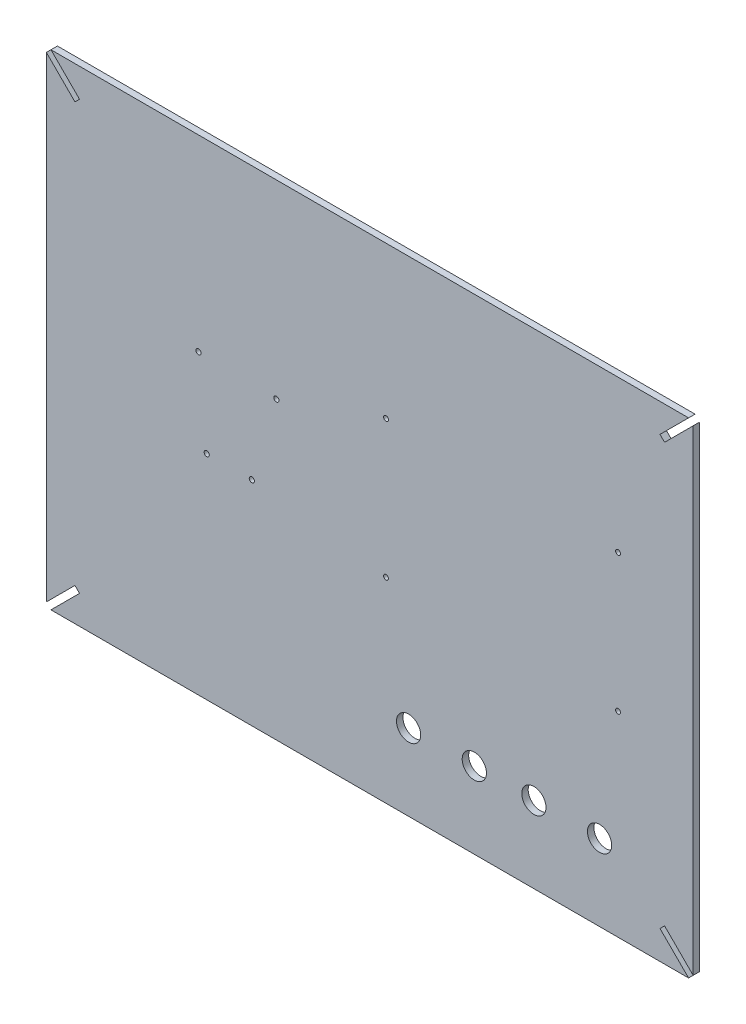
ISO-10303-21;
HEADER;
FILE_DESCRIPTION(('STEP AP214'),'2;1');
FILE_NAME('part.step','',(''),(''),'','','');
FILE_SCHEMA(('AUTOMOTIVE_DESIGN { 1 0 10303 214 1 1 1 1 }'));
ENDSEC;
DATA;
#1=APPLICATION_CONTEXT('core data for automotive mechanical design processes');
#2=APPLICATION_PROTOCOL_DEFINITION('international standard','automotive_design',2000,#1);
#3=PRODUCT_CONTEXT('',#1,'mechanical');
#4=PRODUCT('Part','Part','',(#3));
#5=PRODUCT_RELATED_PRODUCT_CATEGORY('part','',(#4));
#6=PRODUCT_DEFINITION_FORMATION('','',#4);
#7=PRODUCT_DEFINITION_CONTEXT('part definition',#1,'design');
#8=PRODUCT_DEFINITION('design','',#6,#7);
#9=PRODUCT_DEFINITION_SHAPE('','',#8);
#10=(LENGTH_UNIT() NAMED_UNIT(*) SI_UNIT(.MILLI.,.METRE.));
#11=(NAMED_UNIT(*) PLANE_ANGLE_UNIT() SI_UNIT($,.RADIAN.));
#12=(NAMED_UNIT(*) SI_UNIT($,.STERADIAN.) SOLID_ANGLE_UNIT());
#13=UNCERTAINTY_MEASURE_WITH_UNIT(LENGTH_MEASURE(1.E-05),#10,'distance_accuracy_value','');
#14=(GEOMETRIC_REPRESENTATION_CONTEXT(3) GLOBAL_UNCERTAINTY_ASSIGNED_CONTEXT((#13)) GLOBAL_UNIT_ASSIGNED_CONTEXT((#10,
#11,#12)) REPRESENTATION_CONTEXT('',''));
#15=CARTESIAN_POINT('',(0.,0.,0.));
#16=DIRECTION('',(0.,0.,1.));
#17=DIRECTION('',(1.,0.,0.));
#18=AXIS2_PLACEMENT_3D('',#15,#16,#17);
#19=CARTESIAN_POINT('',(-426.178692145528,101.472557330727,4.));
#20=DIRECTION('',(0.,0.,-1.));
#21=DIRECTION('',(-1.,0.,0.));
#22=AXIS2_PLACEMENT_3D('',#19,#20,#21);
#23=PLANE('',#22);
#24=CARTESIAN_POINT('',(-182.029788799938,-133.60477313961,4.));
#25=DIRECTION('',(0.,0.,1.));
#26=DIRECTION('',(1.,0.,0.));
#27=AXIS2_PLACEMENT_3D('',#24,#25,#26);
#28=CIRCLE('',#27,7.50000000000001);
#29=CARTESIAN_POINT('',(-174.529788799938,-133.60477313961,4.));
#30=VERTEX_POINT('',#29);
#31=EDGE_CURVE('E374',#30,#30,#28,.T.);
#32=ORIENTED_EDGE('',*,*,#31,.F.);
#33=EDGE_LOOP('',(#32));
#34=FACE_BOUND('',#33,.T.);
#35=CARTESIAN_POINT('',(-104.559788799938,-133.60477313961,4.));
#36=DIRECTION('',(0.,0.,1.));
#37=DIRECTION('',(1.,0.,0.));
#38=AXIS2_PLACEMENT_3D('',#35,#36,#37);
#39=CIRCLE('',#38,7.50000000000001);
#40=CARTESIAN_POINT('',(-97.0597887999377,-133.60477313961,4.));
#41=VERTEX_POINT('',#40);
#42=EDGE_CURVE('E386',#41,#41,#39,.T.);
#43=ORIENTED_EDGE('',*,*,#42,.F.);
#44=EDGE_LOOP('',(#43));
#45=FACE_BOUND('',#44,.T.);
#46=CARTESIAN_POINT('',(-352.634788799938,3.05022686039043,4.));
#47=DIRECTION('',(0.,0.,1.));
#48=DIRECTION('',(1.,0.,0.));
#49=AXIS2_PLACEMENT_3D('',#46,#47,#48);
#50=CIRCLE('',#49,1.59999999999996);
#51=CARTESIAN_POINT('',(-351.034788799938,3.05022686039043,4.));
#52=VERTEX_POINT('',#51);
#53=EDGE_CURVE('E398',#52,#52,#50,.T.);
#54=ORIENTED_EDGE('',*,*,#53,.F.);
#55=EDGE_LOOP('',(#54));
#56=FACE_BOUND('',#55,.T.);
#57=CARTESIAN_POINT('',(-347.534788799938,-49.0497731396096,4.));
#58=DIRECTION('',(0.,0.,1.));
#59=DIRECTION('',(1.,0.,0.));
#60=AXIS2_PLACEMENT_3D('',#57,#58,#59);
#61=CIRCLE('',#60,1.59999999999996);
#62=CARTESIAN_POINT('',(-345.934788799938,-49.0497731396096,4.));
#63=VERTEX_POINT('',#62);
#64=EDGE_CURVE('E410',#63,#63,#61,.T.);
#65=ORIENTED_EDGE('',*,*,#64,.F.);
#66=EDGE_LOOP('',(#65));
#67=FACE_BOUND('',#66,.T.);
#68=CARTESIAN_POINT('',(-236.639788799938,-59.7947731396096,4.));
#69=DIRECTION('',(0.,0.,1.));
#70=DIRECTION('',(-1.,0.,0.));
#71=AXIS2_PLACEMENT_3D('',#68,#69,#70);
#72=CIRCLE('',#71,1.5);
#73=CARTESIAN_POINT('',(-238.139788799938,-59.7947731396096,4.));
#74=VERTEX_POINT('',#73);
#75=EDGE_CURVE('E422',#74,#74,#72,.T.);
#76=ORIENTED_EDGE('',*,*,#75,.F.);
#77=EDGE_LOOP('',(#76));
#78=FACE_BOUND('',#77,.T.);
#79=CARTESIAN_POINT('',(-236.639788799938,25.2952268603904,4.));
#80=DIRECTION('',(0.,0.,1.));
#81=DIRECTION('',(1.,0.,0.));
#82=AXIS2_PLACEMENT_3D('',#79,#80,#81);
#83=CIRCLE('',#82,1.5);
#84=CARTESIAN_POINT('',(-235.139788799938,25.2952268603904,4.));
#85=VERTEX_POINT('',#84);
#86=EDGE_CURVE('E180',#85,#85,#83,.T.);
#87=ORIENTED_EDGE('',*,*,#86,.F.);
#88=EDGE_LOOP('',(#87));
#89=FACE_BOUND('',#88,.T.);
#90=DIRECTION('',(0.707106781186548,-0.707106781186547,0.));
#91=VECTOR('',#90,1.);
#92=CARTESIAN_POINT('',(-443.856361675192,119.15022686039,4.));
#93=LINE('',#92,#91);
#94=CARTESIAN_POINT('',(-443.856361675192,119.15022686039,4.));
#95=VERTEX_POINT('',#94);
#96=CARTESIAN_POINT('',(-426.178692145528,101.472557330727,4.));
#97=VERTEX_POINT('',#96);
#98=EDGE_CURVE('E207',#95,#97,#93,.T.);
#99=ORIENTED_EDGE('',*,*,#98,.T.);
#100=DIRECTION('',(-0.707106781186547,-0.707106781186547,0.));
#101=VECTOR('',#100,1.);
#102=CARTESIAN_POINT('',(-426.178692145528,101.472557330727,4.));
#103=LINE('',#102,#101);
#104=CARTESIAN_POINT('',(-429.007119270274,98.6441302059806,4.));
#105=VERTEX_POINT('',#104);
#106=EDGE_CURVE('E115',#97,#105,#103,.T.);
#107=ORIENTED_EDGE('',*,*,#106,.T.);
#108=DIRECTION('',(-0.707106781186546,0.707106781186549,0.));
#109=VECTOR('',#108,1.);
#110=CARTESIAN_POINT('',(-429.007119270274,98.6441302059806,4.));
#111=LINE('',#110,#109);
#112=CARTESIAN_POINT('',(-446.684788799938,116.321799735644,4.));
#113=VERTEX_POINT('',#112);
#114=EDGE_CURVE('E246',#105,#113,#111,.T.);
#115=ORIENTED_EDGE('',*,*,#114,.T.);
#116=DIRECTION('',(0.,-1.,0.));
#117=VECTOR('',#116,1.);
#118=CARTESIAN_POINT('',(-446.684788799938,116.321799735644,4.));
#119=LINE('',#118,#117);
#120=CARTESIAN_POINT('',(-446.684788799937,-178.021346014864,4.));
#121=VERTEX_POINT('',#120);
#122=EDGE_CURVE('E265',#113,#121,#119,.T.);
#123=ORIENTED_EDGE('',*,*,#122,.T.);
#124=DIRECTION('',(0.707106781186544,0.707106781186551,0.));
#125=VECTOR('',#124,1.);
#126=CARTESIAN_POINT('',(-429.007119270274,-160.3436764852,4.));
#127=LINE('',#126,#125);
#128=CARTESIAN_POINT('',(-429.007119270274,-160.3436764852,4.));
#129=VERTEX_POINT('',#128);
#130=EDGE_CURVE('E262',#121,#129,#127,.T.);
#131=ORIENTED_EDGE('',*,*,#130,.T.);
#132=DIRECTION('',(0.707106781186554,-0.707106781186541,0.));
#133=VECTOR('',#132,1.);
#134=CARTESIAN_POINT('',(-426.178692145527,-163.172103609946,4.));
#135=LINE('',#134,#133);
#136=CARTESIAN_POINT('',(-426.178692145527,-163.172103609946,4.));
#137=VERTEX_POINT('',#136);
#138=EDGE_CURVE('E264',#129,#137,#135,.T.);
#139=ORIENTED_EDGE('',*,*,#138,.T.);
#140=DIRECTION('',(-0.707106781186548,-0.707106781186547,0.));
#141=VECTOR('',#140,1.);
#142=CARTESIAN_POINT('',(-443.856361675191,-180.84977313961,4.));
#143=LINE('',#142,#141);
#144=CARTESIAN_POINT('',(-443.856361675191,-180.84977313961,4.));
#145=VERTEX_POINT('',#144);
#146=EDGE_CURVE('E267',#137,#145,#143,.T.);
#147=ORIENTED_EDGE('',*,*,#146,.T.);
#148=DIRECTION('',(1.,0.,0.));
#149=VECTOR('',#148,1.);
#150=CARTESIAN_POINT('',(-443.856361675191,-180.84977313961,4.));
#151=LINE('',#150,#149);
#152=CARTESIAN_POINT('',(-49.5132159246837,-180.84977313961,4.));
#153=VERTEX_POINT('',#152);
#154=EDGE_CURVE('E273',#145,#153,#151,.T.);
#155=ORIENTED_EDGE('',*,*,#154,.T.);
#156=DIRECTION('',(-0.70710678118655,0.707106781186546,0.));
#157=VECTOR('',#156,1.);
#158=CARTESIAN_POINT('',(-67.1908854543475,-163.172103609946,4.));
#159=LINE('',#158,#157);
#160=CARTESIAN_POINT('',(-67.1908854543475,-163.172103609946,4.));
#161=VERTEX_POINT('',#160);
#162=EDGE_CURVE('E275',#153,#161,#159,.T.);
#163=ORIENTED_EDGE('',*,*,#162,.T.);
#164=DIRECTION('',(0.707106781186539,0.707106781186556,0.));
#165=VECTOR('',#164,1.);
#166=CARTESIAN_POINT('',(-64.3624583296013,-160.3436764852,4.));
#167=LINE('',#166,#165);
#168=CARTESIAN_POINT('',(-64.3624583296013,-160.3436764852,4.));
#169=VERTEX_POINT('',#168);
#170=EDGE_CURVE('E277',#161,#169,#167,.T.);
#171=ORIENTED_EDGE('',*,*,#170,.T.);
#172=DIRECTION('',(0.707106781186549,-0.707106781186547,0.));
#173=VECTOR('',#172,1.);
#174=CARTESIAN_POINT('',(-46.6847887999376,-178.021346014864,4.));
#175=LINE('',#174,#173);
#176=CARTESIAN_POINT('',(-46.6847887999376,-178.021346014864,4.));
#177=VERTEX_POINT('',#176);
#178=EDGE_CURVE('E279',#169,#177,#175,.T.);
#179=ORIENTED_EDGE('',*,*,#178,.T.);
#180=DIRECTION('',(0.,1.,0.));
#181=VECTOR('',#180,1.);
#182=CARTESIAN_POINT('',(-46.6847887999376,-178.021346014864,4.));
#183=LINE('',#182,#181);
#184=CARTESIAN_POINT('',(-46.6847887999377,116.321799735644,4.));
#185=VERTEX_POINT('',#184);
#186=EDGE_CURVE('E281',#177,#185,#183,.T.);
#187=ORIENTED_EDGE('',*,*,#186,.T.);
#188=DIRECTION('',(-0.707106781186546,-0.707106781186549,0.));
#189=VECTOR('',#188,1.);
#190=CARTESIAN_POINT('',(-46.6847887999377,116.321799735644,4.));
#191=LINE('',#190,#189);
#192=CARTESIAN_POINT('',(-64.3624583296014,98.6441302059805,4.));
#193=VERTEX_POINT('',#192);
#194=EDGE_CURVE('E158',#185,#193,#191,.T.);
#195=ORIENTED_EDGE('',*,*,#194,.T.);
#196=DIRECTION('',(-0.707106781186553,0.707106781186542,0.));
#197=VECTOR('',#196,1.);
#198=CARTESIAN_POINT('',(-64.3624583296014,98.6441302059805,4.));
#199=LINE('',#198,#197);
#200=CARTESIAN_POINT('',(-67.1908854543476,101.472557330727,4.));
#201=VERTEX_POINT('',#200);
#202=EDGE_CURVE('E152',#193,#201,#199,.T.);
#203=ORIENTED_EDGE('',*,*,#202,.T.);
#204=DIRECTION('',(0.707106781186546,0.707106781186549,0.));
#205=VECTOR('',#204,1.);
#206=CARTESIAN_POINT('',(-67.1908854543476,101.472557330727,4.));
#207=LINE('',#206,#205);
#208=CARTESIAN_POINT('',(-49.5132159246839,119.15022686039,4.));
#209=VERTEX_POINT('',#208);
#210=EDGE_CURVE('E156',#201,#209,#207,.T.);
#211=ORIENTED_EDGE('',*,*,#210,.T.);
#212=DIRECTION('',(-1.,0.,0.));
#213=VECTOR('',#212,1.);
#214=CARTESIAN_POINT('',(-443.856361675192,119.15022686039,4.));
#215=LINE('',#214,#213);
#216=EDGE_CURVE('E48',#209,#95,#215,.T.);
#217=ORIENTED_EDGE('',*,*,#216,.T.);
#218=EDGE_LOOP('',(#99,#107,#115,#123,#131,#139,#147,#155,#163,#171,#179,#187,#195,#203,#211,#217));
#219=FACE_BOUND('',#218,.T.);
#220=CARTESIAN_POINT('',(-93.1297887999377,25.2952268603905,4.));
#221=DIRECTION('',(0.,0.,1.));
#222=DIRECTION('',(-1.,0.,0.));
#223=AXIS2_PLACEMENT_3D('',#220,#221,#222);
#224=CIRCLE('',#223,1.5);
#225=CARTESIAN_POINT('',(-94.6297887999377,25.2952268603905,4.));
#226=VERTEX_POINT('',#225);
#227=EDGE_CURVE('E428',#226,#226,#224,.T.);
#228=ORIENTED_EDGE('',*,*,#227,.F.);
#229=EDGE_LOOP('',(#228));
#230=FACE_BOUND('',#229,.T.);
#231=CARTESIAN_POINT('',(-93.1297887999377,-59.7947731396095,4.));
#232=DIRECTION('',(0.,0.,1.));
#233=DIRECTION('',(1.,0.,0.));
#234=AXIS2_PLACEMENT_3D('',#231,#232,#233);
#235=CIRCLE('',#234,1.5);
#236=CARTESIAN_POINT('',(-91.6297887999377,-59.7947731396095,4.));
#237=VERTEX_POINT('',#236);
#238=EDGE_CURVE('E416',#237,#237,#235,.T.);
#239=ORIENTED_EDGE('',*,*,#238,.F.);
#240=EDGE_LOOP('',(#239));
#241=FACE_BOUND('',#240,.T.);
#242=CARTESIAN_POINT('',(-319.634788799938,-49.0497731396096,4.));
#243=DIRECTION('',(0.,0.,1.));
#244=DIRECTION('',(1.,0.,0.));
#245=AXIS2_PLACEMENT_3D('',#242,#243,#244);
#246=CIRCLE('',#245,1.59999999999996);
#247=CARTESIAN_POINT('',(-318.034788799938,-49.0497731396096,4.));
#248=VERTEX_POINT('',#247);
#249=EDGE_CURVE('E404',#248,#248,#246,.T.);
#250=ORIENTED_EDGE('',*,*,#249,.F.);
#251=EDGE_LOOP('',(#250));
#252=FACE_BOUND('',#251,.T.);
#253=CARTESIAN_POINT('',(-304.434788799938,1.75022686039043,4.));
#254=DIRECTION('',(0.,0.,1.));
#255=DIRECTION('',(1.,0.,0.));
#256=AXIS2_PLACEMENT_3D('',#253,#254,#255);
#257=CIRCLE('',#256,1.59999999999996);
#258=CARTESIAN_POINT('',(-302.834788799938,1.75022686039043,4.));
#259=VERTEX_POINT('',#258);
#260=EDGE_CURVE('E392',#259,#259,#257,.T.);
#261=ORIENTED_EDGE('',*,*,#260,.F.);
#262=EDGE_LOOP('',(#261));
#263=FACE_BOUND('',#262,.T.);
#264=CARTESIAN_POINT('',(-145.199788799938,-133.60477313961,4.));
#265=DIRECTION('',(0.,0.,1.));
#266=DIRECTION('',(1.,0.,0.));
#267=AXIS2_PLACEMENT_3D('',#264,#265,#266);
#268=CIRCLE('',#267,7.50000000000001);
#269=CARTESIAN_POINT('',(-137.699788799938,-133.60477313961,4.));
#270=VERTEX_POINT('',#269);
#271=EDGE_CURVE('E380',#270,#270,#268,.T.);
#272=ORIENTED_EDGE('',*,*,#271,.F.);
#273=EDGE_LOOP('',(#272));
#274=FACE_BOUND('',#273,.T.);
#275=CARTESIAN_POINT('',(-222.669788799938,-133.60477313961,4.));
#276=DIRECTION('',(0.,0.,1.));
#277=DIRECTION('',(1.,0.,0.));
#278=AXIS2_PLACEMENT_3D('',#275,#276,#277);
#279=CIRCLE('',#278,7.50000000000001);
#280=CARTESIAN_POINT('',(-215.169788799938,-133.60477313961,4.));
#281=VERTEX_POINT('',#280);
#282=EDGE_CURVE('E365',#281,#281,#279,.T.);
#283=ORIENTED_EDGE('',*,*,#282,.F.);
#284=EDGE_LOOP('',(#283));
#285=FACE_BOUND('',#284,.T.);
#286=ADVANCED_FACE('F31',(#34,#45,#56,#67,#78,#89,#219,#230,#241,#252,#263,#274,#285),#23,.F.);
#287=CARTESIAN_POINT('',(-426.178692145528,101.472557330727,0.));
#288=DIRECTION('',(0.,0.,-1.));
#289=DIRECTION('',(-1.,0.,0.));
#290=AXIS2_PLACEMENT_3D('',#287,#288,#289);
#291=PLANE('',#290);
#292=CARTESIAN_POINT('',(-182.029788799938,-133.60477313961,0.));
#293=DIRECTION('',(0.,0.,1.));
#294=DIRECTION('',(1.,0.,0.));
#295=AXIS2_PLACEMENT_3D('',#292,#293,#294);
#296=CIRCLE('',#295,7.50000000000001);
#297=CARTESIAN_POINT('',(-174.529788799938,-133.60477313961,0.));
#298=VERTEX_POINT('',#297);
#299=EDGE_CURVE('E371',#298,#298,#296,.T.);
#300=ORIENTED_EDGE('',*,*,#299,.T.);
#301=EDGE_LOOP('',(#300));
#302=FACE_BOUND('',#301,.T.);
#303=CARTESIAN_POINT('',(-104.559788799938,-133.60477313961,0.));
#304=DIRECTION('',(0.,0.,1.));
#305=DIRECTION('',(1.,0.,0.));
#306=AXIS2_PLACEMENT_3D('',#303,#304,#305);
#307=CIRCLE('',#306,7.50000000000001);
#308=CARTESIAN_POINT('',(-97.0597887999377,-133.60477313961,0.));
#309=VERTEX_POINT('',#308);
#310=EDGE_CURVE('E383',#309,#309,#307,.T.);
#311=ORIENTED_EDGE('',*,*,#310,.T.);
#312=EDGE_LOOP('',(#311));
#313=FACE_BOUND('',#312,.T.);
#314=CARTESIAN_POINT('',(-352.634788799938,3.05022686039043,0.));
#315=DIRECTION('',(0.,0.,1.));
#316=DIRECTION('',(1.,0.,0.));
#317=AXIS2_PLACEMENT_3D('',#314,#315,#316);
#318=CIRCLE('',#317,1.59999999999996);
#319=CARTESIAN_POINT('',(-351.034788799938,3.05022686039043,0.));
#320=VERTEX_POINT('',#319);
#321=EDGE_CURVE('E395',#320,#320,#318,.T.);
#322=ORIENTED_EDGE('',*,*,#321,.T.);
#323=EDGE_LOOP('',(#322));
#324=FACE_BOUND('',#323,.T.);
#325=CARTESIAN_POINT('',(-347.534788799938,-49.0497731396096,0.));
#326=DIRECTION('',(0.,0.,1.));
#327=DIRECTION('',(1.,0.,0.));
#328=AXIS2_PLACEMENT_3D('',#325,#326,#327);
#329=CIRCLE('',#328,1.59999999999996);
#330=CARTESIAN_POINT('',(-345.934788799938,-49.0497731396096,0.));
#331=VERTEX_POINT('',#330);
#332=EDGE_CURVE('E407',#331,#331,#329,.T.);
#333=ORIENTED_EDGE('',*,*,#332,.T.);
#334=EDGE_LOOP('',(#333));
#335=FACE_BOUND('',#334,.T.);
#336=CARTESIAN_POINT('',(-236.639788799938,-59.7947731396096,0.));
#337=DIRECTION('',(0.,0.,1.));
#338=DIRECTION('',(-1.,0.,0.));
#339=AXIS2_PLACEMENT_3D('',#336,#337,#338);
#340=CIRCLE('',#339,1.5);
#341=CARTESIAN_POINT('',(-238.139788799938,-59.7947731396096,0.));
#342=VERTEX_POINT('',#341);
#343=EDGE_CURVE('E419',#342,#342,#340,.T.);
#344=ORIENTED_EDGE('',*,*,#343,.T.);
#345=EDGE_LOOP('',(#344));
#346=FACE_BOUND('',#345,.T.);
#347=CARTESIAN_POINT('',(-236.639788799938,25.2952268603904,0.));
#348=DIRECTION('',(0.,0.,1.));
#349=DIRECTION('',(1.,0.,0.));
#350=AXIS2_PLACEMENT_3D('',#347,#348,#349);
#351=CIRCLE('',#350,1.5);
#352=CARTESIAN_POINT('',(-235.139788799938,25.2952268603904,0.));
#353=VERTEX_POINT('',#352);
#354=EDGE_CURVE('E431',#353,#353,#351,.T.);
#355=ORIENTED_EDGE('',*,*,#354,.T.);
#356=EDGE_LOOP('',(#355));
#357=FACE_BOUND('',#356,.T.);
#358=DIRECTION('',(0.707106781186548,-0.707106781186547,0.));
#359=VECTOR('',#358,1.);
#360=CARTESIAN_POINT('',(-443.856361675192,119.15022686039,0.));
#361=LINE('',#360,#359);
#362=CARTESIAN_POINT('',(-443.856361675192,119.15022686039,0.));
#363=VERTEX_POINT('',#362);
#364=CARTESIAN_POINT('',(-426.178692145528,101.472557330727,0.));
#365=VERTEX_POINT('',#364);
#366=EDGE_CURVE('E176',#363,#365,#361,.T.);
#367=ORIENTED_EDGE('',*,*,#366,.F.);
#368=DIRECTION('',(-1.,0.,0.));
#369=VECTOR('',#368,1.);
#370=CARTESIAN_POINT('',(-443.856361675192,119.15022686039,0.));
#371=LINE('',#370,#369);
#372=CARTESIAN_POINT('',(-49.5132159246839,119.15022686039,0.));
#373=VERTEX_POINT('',#372);
#374=EDGE_CURVE('E107',#373,#363,#371,.T.);
#375=ORIENTED_EDGE('',*,*,#374,.F.);
#376=DIRECTION('',(0.707106781186546,0.707106781186549,0.));
#377=VECTOR('',#376,1.);
#378=CARTESIAN_POINT('',(-67.1908854543476,101.472557330727,0.));
#379=LINE('',#378,#377);
#380=CARTESIAN_POINT('',(-67.1908854543476,101.472557330727,0.));
#381=VERTEX_POINT('',#380);
#382=EDGE_CURVE('E101',#381,#373,#379,.T.);
#383=ORIENTED_EDGE('',*,*,#382,.F.);
#384=DIRECTION('',(-0.707106781186553,0.707106781186542,0.));
#385=VECTOR('',#384,1.);
#386=CARTESIAN_POINT('',(-64.3624583296014,98.6441302059805,0.));
#387=LINE('',#386,#385);
#388=CARTESIAN_POINT('',(-64.3624583296014,98.6441302059805,0.));
#389=VERTEX_POINT('',#388);
#390=EDGE_CURVE('E166',#389,#381,#387,.T.);
#391=ORIENTED_EDGE('',*,*,#390,.F.);
#392=DIRECTION('',(-0.707106781186546,-0.707106781186549,0.));
#393=VECTOR('',#392,1.);
#394=CARTESIAN_POINT('',(-46.6847887999377,116.321799735644,0.));
#395=LINE('',#394,#393);
#396=CARTESIAN_POINT('',(-46.6847887999377,116.321799735644,0.));
#397=VERTEX_POINT('',#396);
#398=EDGE_CURVE('E202',#397,#389,#395,.T.);
#399=ORIENTED_EDGE('',*,*,#398,.F.);
#400=DIRECTION('',(0.,1.,0.));
#401=VECTOR('',#400,1.);
#402=CARTESIAN_POINT('',(-46.6847887999376,-178.021346014864,0.));
#403=LINE('',#402,#401);
#404=CARTESIAN_POINT('',(-46.6847887999376,-178.021346014864,0.));
#405=VERTEX_POINT('',#404);
#406=EDGE_CURVE('E200',#405,#397,#403,.T.);
#407=ORIENTED_EDGE('',*,*,#406,.F.);
#408=DIRECTION('',(0.707106781186549,-0.707106781186547,0.));
#409=VECTOR('',#408,1.);
#410=CARTESIAN_POINT('',(-46.6847887999376,-178.021346014864,0.));
#411=LINE('',#410,#409);
#412=CARTESIAN_POINT('',(-64.3624583296013,-160.3436764852,0.));
#413=VERTEX_POINT('',#412);
#414=EDGE_CURVE('E198',#413,#405,#411,.T.);
#415=ORIENTED_EDGE('',*,*,#414,.F.);
#416=DIRECTION('',(0.707106781186539,0.707106781186556,0.));
#417=VECTOR('',#416,1.);
#418=CARTESIAN_POINT('',(-64.3624583296013,-160.3436764852,0.));
#419=LINE('',#418,#417);
#420=CARTESIAN_POINT('',(-67.1908854543475,-163.172103609946,0.));
#421=VERTEX_POINT('',#420);
#422=EDGE_CURVE('E196',#421,#413,#419,.T.);
#423=ORIENTED_EDGE('',*,*,#422,.F.);
#424=DIRECTION('',(-0.70710678118655,0.707106781186546,0.));
#425=VECTOR('',#424,1.);
#426=CARTESIAN_POINT('',(-67.1908854543475,-163.172103609946,0.));
#427=LINE('',#426,#425);
#428=CARTESIAN_POINT('',(-49.5132159246837,-180.84977313961,0.));
#429=VERTEX_POINT('',#428);
#430=EDGE_CURVE('E194',#429,#421,#427,.T.);
#431=ORIENTED_EDGE('',*,*,#430,.F.);
#432=DIRECTION('',(1.,0.,0.));
#433=VECTOR('',#432,1.);
#434=CARTESIAN_POINT('',(-443.856361675191,-180.84977313961,0.));
#435=LINE('',#434,#433);
#436=CARTESIAN_POINT('',(-443.856361675191,-180.84977313961,0.));
#437=VERTEX_POINT('',#436);
#438=EDGE_CURVE('E192',#437,#429,#435,.T.);
#439=ORIENTED_EDGE('',*,*,#438,.F.);
#440=DIRECTION('',(-0.707106781186548,-0.707106781186547,0.));
#441=VECTOR('',#440,1.);
#442=CARTESIAN_POINT('',(-443.856361675191,-180.84977313961,0.));
#443=LINE('',#442,#441);
#444=CARTESIAN_POINT('',(-426.178692145527,-163.172103609946,0.));
#445=VERTEX_POINT('',#444);
#446=EDGE_CURVE('E190',#445,#437,#443,.T.);
#447=ORIENTED_EDGE('',*,*,#446,.F.);
#448=DIRECTION('',(0.707106781186554,-0.707106781186541,0.));
#449=VECTOR('',#448,1.);
#450=CARTESIAN_POINT('',(-426.178692145527,-163.172103609946,0.));
#451=LINE('',#450,#449);
#452=CARTESIAN_POINT('',(-429.007119270274,-160.3436764852,0.));
#453=VERTEX_POINT('',#452);
#454=EDGE_CURVE('E188',#453,#445,#451,.T.);
#455=ORIENTED_EDGE('',*,*,#454,.F.);
#456=DIRECTION('',(0.707106781186544,0.707106781186551,0.));
#457=VECTOR('',#456,1.);
#458=CARTESIAN_POINT('',(-429.007119270274,-160.3436764852,0.));
#459=LINE('',#458,#457);
#460=CARTESIAN_POINT('',(-446.684788799937,-178.021346014864,0.));
#461=VERTEX_POINT('',#460);
#462=EDGE_CURVE('E186',#461,#453,#459,.T.);
#463=ORIENTED_EDGE('',*,*,#462,.F.);
#464=DIRECTION('',(0.,-1.,0.));
#465=VECTOR('',#464,1.);
#466=CARTESIAN_POINT('',(-446.684788799938,116.321799735644,0.));
#467=LINE('',#466,#465);
#468=CARTESIAN_POINT('',(-446.684788799938,116.321799735644,0.));
#469=VERTEX_POINT('',#468);
#470=EDGE_CURVE('E184',#469,#461,#467,.T.);
#471=ORIENTED_EDGE('',*,*,#470,.F.);
#472=DIRECTION('',(-0.707106781186546,0.707106781186549,0.));
#473=VECTOR('',#472,1.);
#474=CARTESIAN_POINT('',(-429.007119270274,98.6441302059806,0.));
#475=LINE('',#474,#473);
#476=CARTESIAN_POINT('',(-429.007119270274,98.6441302059806,0.));
#477=VERTEX_POINT('',#476);
#478=EDGE_CURVE('E182',#477,#469,#475,.T.);
#479=ORIENTED_EDGE('',*,*,#478,.F.);
#480=DIRECTION('',(-0.707106781186547,-0.707106781186547,0.));
#481=VECTOR('',#480,1.);
#482=CARTESIAN_POINT('',(-426.178692145528,101.472557330727,0.));
#483=LINE('',#482,#481);
#484=EDGE_CURVE('E179',#365,#477,#483,.T.);
#485=ORIENTED_EDGE('',*,*,#484,.F.);
#486=EDGE_LOOP('',(#367,#375,#383,#391,#399,#407,#415,#423,#431,#439,#447,#455,#463,#471,#479,#485));
#487=FACE_BOUND('',#486,.T.);
#488=CARTESIAN_POINT('',(-93.1297887999377,25.2952268603905,0.));
#489=DIRECTION('',(0.,0.,1.));
#490=DIRECTION('',(-1.,0.,0.));
#491=AXIS2_PLACEMENT_3D('',#488,#489,#490);
#492=CIRCLE('',#491,1.5);
#493=CARTESIAN_POINT('',(-94.6297887999377,25.2952268603905,0.));
#494=VERTEX_POINT('',#493);
#495=EDGE_CURVE('E425',#494,#494,#492,.T.);
#496=ORIENTED_EDGE('',*,*,#495,.T.);
#497=EDGE_LOOP('',(#496));
#498=FACE_BOUND('',#497,.T.);
#499=CARTESIAN_POINT('',(-93.1297887999377,-59.7947731396095,0.));
#500=DIRECTION('',(0.,0.,1.));
#501=DIRECTION('',(1.,0.,0.));
#502=AXIS2_PLACEMENT_3D('',#499,#500,#501);
#503=CIRCLE('',#502,1.5);
#504=CARTESIAN_POINT('',(-91.6297887999377,-59.7947731396095,0.));
#505=VERTEX_POINT('',#504);
#506=EDGE_CURVE('E413',#505,#505,#503,.T.);
#507=ORIENTED_EDGE('',*,*,#506,.T.);
#508=EDGE_LOOP('',(#507));
#509=FACE_BOUND('',#508,.T.);
#510=CARTESIAN_POINT('',(-319.634788799938,-49.0497731396096,0.));
#511=DIRECTION('',(0.,0.,1.));
#512=DIRECTION('',(1.,0.,0.));
#513=AXIS2_PLACEMENT_3D('',#510,#511,#512);
#514=CIRCLE('',#513,1.59999999999996);
#515=CARTESIAN_POINT('',(-318.034788799938,-49.0497731396096,0.));
#516=VERTEX_POINT('',#515);
#517=EDGE_CURVE('E401',#516,#516,#514,.T.);
#518=ORIENTED_EDGE('',*,*,#517,.T.);
#519=EDGE_LOOP('',(#518));
#520=FACE_BOUND('',#519,.T.);
#521=CARTESIAN_POINT('',(-304.434788799938,1.75022686039043,0.));
#522=DIRECTION('',(0.,0.,1.));
#523=DIRECTION('',(1.,0.,0.));
#524=AXIS2_PLACEMENT_3D('',#521,#522,#523);
#525=CIRCLE('',#524,1.59999999999996);
#526=CARTESIAN_POINT('',(-302.834788799938,1.75022686039043,0.));
#527=VERTEX_POINT('',#526);
#528=EDGE_CURVE('E389',#527,#527,#525,.T.);
#529=ORIENTED_EDGE('',*,*,#528,.T.);
#530=EDGE_LOOP('',(#529));
#531=FACE_BOUND('',#530,.T.);
#532=CARTESIAN_POINT('',(-145.199788799938,-133.60477313961,0.));
#533=DIRECTION('',(0.,0.,1.));
#534=DIRECTION('',(1.,0.,0.));
#535=AXIS2_PLACEMENT_3D('',#532,#533,#534);
#536=CIRCLE('',#535,7.50000000000001);
#537=CARTESIAN_POINT('',(-137.699788799938,-133.60477313961,0.));
#538=VERTEX_POINT('',#537);
#539=EDGE_CURVE('E377',#538,#538,#536,.T.);
#540=ORIENTED_EDGE('',*,*,#539,.T.);
#541=EDGE_LOOP('',(#540));
#542=FACE_BOUND('',#541,.T.);
#543=CARTESIAN_POINT('',(-222.669788799938,-133.60477313961,0.));
#544=DIRECTION('',(0.,0.,1.));
#545=DIRECTION('',(1.,0.,0.));
#546=AXIS2_PLACEMENT_3D('',#543,#544,#545);
#547=CIRCLE('',#546,7.50000000000001);
#548=CARTESIAN_POINT('',(-215.169788799938,-133.60477313961,0.));
#549=VERTEX_POINT('',#548);
#550=EDGE_CURVE('E368',#549,#549,#547,.T.);
#551=ORIENTED_EDGE('',*,*,#550,.T.);
#552=EDGE_LOOP('',(#551));
#553=FACE_BOUND('',#552,.T.);
#554=ADVANCED_FACE('F250',(#302,#313,#324,#335,#346,#357,#487,#498,#509,#520,#531,#542,#553),
#291,.T.);
#555=CARTESIAN_POINT('',(-443.856361675192,119.15022686039,4.));
#556=DIRECTION('',(0.707106781186547,0.707106781186548,0.));
#557=DIRECTION('',(-0.707106781186548,0.707106781186547,0.));
#558=AXIS2_PLACEMENT_3D('',#555,#556,#557);
#559=PLANE('',#558);
#560=ORIENTED_EDGE('',*,*,#366,.T.);
#561=DIRECTION('',(0.,0.,-1.));
#562=VECTOR('',#561,1.);
#563=CARTESIAN_POINT('',(-426.178692145528,101.472557330727,4.));
#564=LINE('',#563,#562);
#565=EDGE_CURVE('E11',#97,#365,#564,.T.);
#566=ORIENTED_EDGE('',*,*,#565,.F.);
#567=ORIENTED_EDGE('',*,*,#98,.F.);
#568=DIRECTION('',(0.,0.,-1.));
#569=VECTOR('',#568,1.);
#570=CARTESIAN_POINT('',(-443.856361675192,119.15022686039,4.));
#571=LINE('',#570,#569);
#572=EDGE_CURVE('E172',#95,#363,#571,.T.);
#573=ORIENTED_EDGE('',*,*,#572,.T.);
#574=EDGE_LOOP('',(#560,#566,#567,#573));
#575=FACE_BOUND('',#574,.T.);
#576=ADVANCED_FACE('F33',(#575),#559,.F.);
#577=CARTESIAN_POINT('',(-426.178692145528,101.472557330727,4.));
#578=DIRECTION('',(0.707106781186547,-0.707106781186547,0.));
#579=DIRECTION('',(0.707106781186548,0.707106781186548,0.));
#580=AXIS2_PLACEMENT_3D('',#577,#578,#579);
#581=PLANE('',#580);
#582=ORIENTED_EDGE('',*,*,#484,.T.);
#583=DIRECTION('',(0.,0.,-1.));
#584=VECTOR('',#583,1.);
#585=CARTESIAN_POINT('',(-429.007119270274,98.6441302059806,4.));
#586=LINE('',#585,#584);
#587=EDGE_CURVE('E40',#105,#477,#586,.T.);
#588=ORIENTED_EDGE('',*,*,#587,.F.);
#589=ORIENTED_EDGE('',*,*,#106,.F.);
#590=ORIENTED_EDGE('',*,*,#565,.T.);
#591=EDGE_LOOP('',(#582,#588,#589,#590));
#592=FACE_BOUND('',#591,.T.);
#593=ADVANCED_FACE('F652',(#592),#581,.F.);
#594=CARTESIAN_POINT('',(-429.007119270274,98.6441302059806,4.));
#595=DIRECTION('',(-0.707106781186549,-0.707106781186546,0.));
#596=DIRECTION('',(0.707106781186546,-0.707106781186549,0.));
#597=AXIS2_PLACEMENT_3D('',#594,#595,#596);
#598=PLANE('',#597);
#599=ORIENTED_EDGE('',*,*,#478,.T.);
#600=DIRECTION('',(0.,0.,-1.));
#601=VECTOR('',#600,1.);
#602=CARTESIAN_POINT('',(-446.684788799938,116.321799735644,4.));
#603=LINE('',#602,#601);
#604=EDGE_CURVE('E238',#113,#469,#603,.T.);
#605=ORIENTED_EDGE('',*,*,#604,.F.);
#606=ORIENTED_EDGE('',*,*,#114,.F.);
#607=ORIENTED_EDGE('',*,*,#587,.T.);
#608=EDGE_LOOP('',(#599,#605,#606,#607));
#609=FACE_BOUND('',#608,.T.);
#610=ADVANCED_FACE('F244',(#609),#598,.F.);
#611=CARTESIAN_POINT('',(-446.684788799938,116.321799735644,4.));
#612=DIRECTION('',(1.,0.,0.));
#613=DIRECTION('',(0.,1.,0.));
#614=AXIS2_PLACEMENT_3D('',#611,#612,#613);
#615=PLANE('',#614);
#616=ORIENTED_EDGE('',*,*,#470,.T.);
#617=DIRECTION('',(0.,0.,-1.));
#618=VECTOR('',#617,1.);
#619=CARTESIAN_POINT('',(-446.684788799937,-178.021346014864,4.));
#620=LINE('',#619,#618);
#621=EDGE_CURVE('E235',#121,#461,#620,.T.);
#622=ORIENTED_EDGE('',*,*,#621,.F.);
#623=ORIENTED_EDGE('',*,*,#122,.F.);
#624=ORIENTED_EDGE('',*,*,#604,.T.);
#625=EDGE_LOOP('',(#616,#622,#623,#624));
#626=FACE_BOUND('',#625,.T.);
#627=ADVANCED_FACE('F256',(#626),#615,.F.);
#628=CARTESIAN_POINT('',(-429.007119270274,-160.3436764852,4.));
#629=DIRECTION('',(-0.707106781186551,0.707106781186544,0.));
#630=DIRECTION('',(-0.707106781186544,-0.707106781186551,0.));
#631=AXIS2_PLACEMENT_3D('',#628,#629,#630);
#632=PLANE('',#631);
#633=ORIENTED_EDGE('',*,*,#462,.T.);
#634=DIRECTION('',(0.,0.,-1.));
#635=VECTOR('',#634,1.);
#636=CARTESIAN_POINT('',(-429.007119270274,-160.3436764852,4.));
#637=LINE('',#636,#635);
#638=EDGE_CURVE('E232',#129,#453,#637,.T.);
#639=ORIENTED_EDGE('',*,*,#638,.F.);
#640=ORIENTED_EDGE('',*,*,#130,.F.);
#641=ORIENTED_EDGE('',*,*,#621,.T.);
#642=EDGE_LOOP('',(#633,#639,#640,#641));
#643=FACE_BOUND('',#642,.T.);
#644=ADVANCED_FACE('F260',(#643),#632,.F.);
#645=CARTESIAN_POINT('',(-426.178692145527,-163.172103609946,4.));
#646=DIRECTION('',(0.707106781186541,0.707106781186554,0.));
#647=DIRECTION('',(-0.707106781186554,0.707106781186541,0.));
#648=AXIS2_PLACEMENT_3D('',#645,#646,#647);
#649=PLANE('',#648);
#650=ORIENTED_EDGE('',*,*,#454,.T.);
#651=DIRECTION('',(0.,0.,-1.));
#652=VECTOR('',#651,1.);
#653=CARTESIAN_POINT('',(-426.178692145527,-163.172103609946,4.));
#654=LINE('',#653,#652);
#655=EDGE_CURVE('E229',#137,#445,#654,.T.);
#656=ORIENTED_EDGE('',*,*,#655,.F.);
#657=ORIENTED_EDGE('',*,*,#138,.F.);
#658=ORIENTED_EDGE('',*,*,#638,.T.);
#659=EDGE_LOOP('',(#650,#656,#657,#658));
#660=FACE_BOUND('',#659,.T.);
#661=ADVANCED_FACE('F617',(#660),#649,.F.);
#662=CARTESIAN_POINT('',(-443.856361675191,-180.84977313961,4.));
#663=DIRECTION('',(0.707106781186547,-0.707106781186548,0.));
#664=DIRECTION('',(0.707106781186548,0.707106781186547,0.));
#665=AXIS2_PLACEMENT_3D('',#662,#663,#664);
#666=PLANE('',#665);
#667=ORIENTED_EDGE('',*,*,#446,.T.);
#668=DIRECTION('',(0.,0.,-1.));
#669=VECTOR('',#668,1.);
#670=CARTESIAN_POINT('',(-443.856361675191,-180.84977313961,4.));
#671=LINE('',#670,#669);
#672=EDGE_CURVE('E226',#145,#437,#671,.T.);
#673=ORIENTED_EDGE('',*,*,#672,.F.);
#674=ORIENTED_EDGE('',*,*,#146,.F.);
#675=ORIENTED_EDGE('',*,*,#655,.T.);
#676=EDGE_LOOP('',(#667,#673,#674,#675));
#677=FACE_BOUND('',#676,.T.);
#678=ADVANCED_FACE('F607',(#677),#666,.F.);
#679=CARTESIAN_POINT('',(-443.856361675191,-180.84977313961,4.));
#680=DIRECTION('',(0.,1.,0.));
#681=DIRECTION('',(0.,0.,1.));
#682=AXIS2_PLACEMENT_3D('',#679,#680,#681);
#683=PLANE('',#682);
#684=ORIENTED_EDGE('',*,*,#438,.T.);
#685=DIRECTION('',(0.,0.,-1.));
#686=VECTOR('',#685,1.);
#687=CARTESIAN_POINT('',(-49.5132159246837,-180.84977313961,4.));
#688=LINE('',#687,#686);
#689=EDGE_CURVE('E223',#153,#429,#688,.T.);
#690=ORIENTED_EDGE('',*,*,#689,.F.);
#691=ORIENTED_EDGE('',*,*,#154,.F.);
#692=ORIENTED_EDGE('',*,*,#672,.T.);
#693=EDGE_LOOP('',(#684,#690,#691,#692));
#694=FACE_BOUND('',#693,.T.);
#695=ADVANCED_FACE('F597',(#694),#683,.F.);
#696=CARTESIAN_POINT('',(-67.1908854543475,-163.172103609946,4.));
#697=DIRECTION('',(-0.707106781186546,-0.70710678118655,0.));
#698=DIRECTION('',(0.70710678118655,-0.707106781186546,0.));
#699=AXIS2_PLACEMENT_3D('',#696,#697,#698);
#700=PLANE('',#699);
#701=ORIENTED_EDGE('',*,*,#430,.T.);
#702=DIRECTION('',(0.,0.,-1.));
#703=VECTOR('',#702,1.);
#704=CARTESIAN_POINT('',(-67.1908854543475,-163.172103609946,4.));
#705=LINE('',#704,#703);
#706=EDGE_CURVE('E220',#161,#421,#705,.T.);
#707=ORIENTED_EDGE('',*,*,#706,.F.);
#708=ORIENTED_EDGE('',*,*,#162,.F.);
#709=ORIENTED_EDGE('',*,*,#689,.T.);
#710=EDGE_LOOP('',(#701,#707,#708,#709));
#711=FACE_BOUND('',#710,.T.);
#712=ADVANCED_FACE('F587',(#711),#700,.F.);
#713=CARTESIAN_POINT('',(-64.3624583296013,-160.3436764852,4.));
#714=DIRECTION('',(-0.707106781186556,0.707106781186539,0.));
#715=DIRECTION('',(-0.707106781186539,-0.707106781186556,0.));
#716=AXIS2_PLACEMENT_3D('',#713,#714,#715);
#717=PLANE('',#716);
#718=ORIENTED_EDGE('',*,*,#422,.T.);
#719=DIRECTION('',(0.,0.,-1.));
#720=VECTOR('',#719,1.);
#721=CARTESIAN_POINT('',(-64.3624583296013,-160.3436764852,4.));
#722=LINE('',#721,#720);
#723=EDGE_CURVE('E217',#169,#413,#722,.T.);
#724=ORIENTED_EDGE('',*,*,#723,.F.);
#725=ORIENTED_EDGE('',*,*,#170,.F.);
#726=ORIENTED_EDGE('',*,*,#706,.T.);
#727=EDGE_LOOP('',(#718,#724,#725,#726));
#728=FACE_BOUND('',#727,.T.);
#729=ADVANCED_FACE('F577',(#728),#717,.F.);
#730=CARTESIAN_POINT('',(-46.6847887999376,-178.021346014864,4.));
#731=DIRECTION('',(0.707106781186547,0.707106781186549,0.));
#732=DIRECTION('',(-0.707106781186549,0.707106781186547,0.));
#733=AXIS2_PLACEMENT_3D('',#730,#731,#732);
#734=PLANE('',#733);
#735=ORIENTED_EDGE('',*,*,#414,.T.);
#736=DIRECTION('',(0.,0.,-1.));
#737=VECTOR('',#736,1.);
#738=CARTESIAN_POINT('',(-46.6847887999376,-178.021346014864,4.));
#739=LINE('',#738,#737);
#740=EDGE_CURVE('E214',#177,#405,#739,.T.);
#741=ORIENTED_EDGE('',*,*,#740,.F.);
#742=ORIENTED_EDGE('',*,*,#178,.F.);
#743=ORIENTED_EDGE('',*,*,#723,.T.);
#744=EDGE_LOOP('',(#735,#741,#742,#743));
#745=FACE_BOUND('',#744,.T.);
#746=ADVANCED_FACE('F568',(#745),#734,.F.);
#747=CARTESIAN_POINT('',(-46.6847887999376,-178.021346014864,4.));
#748=DIRECTION('',(-1.,0.,0.));
#749=DIRECTION('',(0.,-1.,0.));
#750=AXIS2_PLACEMENT_3D('',#747,#748,#749);
#751=PLANE('',#750);
#752=ORIENTED_EDGE('',*,*,#406,.T.);
#753=DIRECTION('',(0.,0.,-1.));
#754=VECTOR('',#753,1.);
#755=CARTESIAN_POINT('',(-46.6847887999377,116.321799735644,4.));
#756=LINE('',#755,#754);
#757=EDGE_CURVE('E211',#185,#397,#756,.T.);
#758=ORIENTED_EDGE('',*,*,#757,.F.);
#759=ORIENTED_EDGE('',*,*,#186,.F.);
#760=ORIENTED_EDGE('',*,*,#740,.T.);
#761=EDGE_LOOP('',(#752,#758,#759,#760));
#762=FACE_BOUND('',#761,.T.);
#763=ADVANCED_FACE('F287',(#762),#751,.F.);
#764=CARTESIAN_POINT('',(-46.6847887999377,116.321799735644,4.));
#765=DIRECTION('',(0.707106781186549,-0.707106781186546,0.));
#766=DIRECTION('',(0.707106781186546,0.707106781186549,0.));
#767=AXIS2_PLACEMENT_3D('',#764,#765,#766);
#768=PLANE('',#767);
#769=ORIENTED_EDGE('',*,*,#398,.T.);
#770=DIRECTION('',(0.,0.,-1.));
#771=VECTOR('',#770,1.);
#772=CARTESIAN_POINT('',(-64.3624583296014,98.6441302059805,4.));
#773=LINE('',#772,#771);
#774=EDGE_CURVE('E167',#193,#389,#773,.T.);
#775=ORIENTED_EDGE('',*,*,#774,.F.);
#776=ORIENTED_EDGE('',*,*,#194,.F.);
#777=ORIENTED_EDGE('',*,*,#757,.T.);
#778=EDGE_LOOP('',(#769,#775,#776,#777));
#779=FACE_BOUND('',#778,.T.);
#780=ADVANCED_FACE('F291',(#779),#768,.F.);
#781=CARTESIAN_POINT('',(-64.3624583296014,98.6441302059805,4.));
#782=DIRECTION('',(-0.707106781186542,-0.707106781186553,0.));
#783=DIRECTION('',(0.707106781186553,-0.707106781186542,0.));
#784=AXIS2_PLACEMENT_3D('',#781,#782,#783);
#785=PLANE('',#784);
#786=ORIENTED_EDGE('',*,*,#390,.T.);
#787=DIRECTION('',(0.,0.,-1.));
#788=VECTOR('',#787,1.);
#789=CARTESIAN_POINT('',(-67.1908854543476,101.472557330727,4.));
#790=LINE('',#789,#788);
#791=EDGE_CURVE('E163',#201,#381,#790,.T.);
#792=ORIENTED_EDGE('',*,*,#791,.F.);
#793=ORIENTED_EDGE('',*,*,#202,.F.);
#794=ORIENTED_EDGE('',*,*,#774,.T.);
#795=EDGE_LOOP('',(#786,#792,#793,#794));
#796=FACE_BOUND('',#795,.T.);
#797=ADVANCED_FACE('F164',(#796),#785,.F.);
#798=CARTESIAN_POINT('',(-67.1908854543476,101.472557330727,4.));
#799=DIRECTION('',(-0.707106781186549,0.707106781186546,0.));
#800=DIRECTION('',(-0.707106781186546,-0.707106781186549,0.));
#801=AXIS2_PLACEMENT_3D('',#798,#799,#800);
#802=PLANE('',#801);
#803=ORIENTED_EDGE('',*,*,#382,.T.);
#804=DIRECTION('',(0.,0.,-1.));
#805=VECTOR('',#804,1.);
#806=CARTESIAN_POINT('',(-49.5132159246839,119.15022686039,4.));
#807=LINE('',#806,#805);
#808=EDGE_CURVE('E168',#209,#373,#807,.T.);
#809=ORIENTED_EDGE('',*,*,#808,.F.);
#810=ORIENTED_EDGE('',*,*,#210,.F.);
#811=ORIENTED_EDGE('',*,*,#791,.T.);
#812=EDGE_LOOP('',(#803,#809,#810,#811));
#813=FACE_BOUND('',#812,.T.);
#814=ADVANCED_FACE('F170',(#813),#802,.F.);
#815=CARTESIAN_POINT('',(-443.856361675192,119.15022686039,4.));
#816=DIRECTION('',(0.,-1.,0.));
#817=DIRECTION('',(1.,0.,0.));
#818=AXIS2_PLACEMENT_3D('',#815,#816,#817);
#819=PLANE('',#818);
#820=ORIENTED_EDGE('',*,*,#374,.T.);
#821=ORIENTED_EDGE('',*,*,#572,.F.);
#822=ORIENTED_EDGE('',*,*,#216,.F.);
#823=ORIENTED_EDGE('',*,*,#808,.T.);
#824=EDGE_LOOP('',(#820,#821,#822,#823));
#825=FACE_BOUND('',#824,.T.);
#826=ADVANCED_FACE('F295',(#825),#819,.F.);
#827=CARTESIAN_POINT('',(-236.639788799938,25.2952268603904,4.));
#828=DIRECTION('',(0.,0.,-1.));
#829=DIRECTION('',(-1.,0.,0.));
#830=AXIS2_PLACEMENT_3D('',#827,#828,#829);
#831=CYLINDRICAL_SURFACE('',#830,1.5);
#832=ORIENTED_EDGE('',*,*,#86,.T.);
#833=EDGE_LOOP('',(#832));
#834=FACE_BOUND('',#833,.T.);
#835=ORIENTED_EDGE('',*,*,#354,.F.);
#836=EDGE_LOOP('',(#835));
#837=FACE_BOUND('',#836,.T.);
#838=ADVANCED_FACE('F297',(#834,#837),#831,.F.);
#839=CARTESIAN_POINT('',(-93.1297887999377,25.2952268603905,4.));
#840=DIRECTION('',(0.,0.,-1.));
#841=DIRECTION('',(-1.,0.,0.));
#842=AXIS2_PLACEMENT_3D('',#839,#840,#841);
#843=CYLINDRICAL_SURFACE('',#842,1.5);
#844=ORIENTED_EDGE('',*,*,#227,.T.);
#845=EDGE_LOOP('',(#844));
#846=FACE_BOUND('',#845,.T.);
#847=ORIENTED_EDGE('',*,*,#495,.F.);
#848=EDGE_LOOP('',(#847));
#849=FACE_BOUND('',#848,.T.);
#850=ADVANCED_FACE('F303',(#846,#849),#843,.F.);
#851=CARTESIAN_POINT('',(-236.639788799938,-59.7947731396096,4.));
#852=DIRECTION('',(0.,0.,-1.));
#853=DIRECTION('',(-1.,0.,0.));
#854=AXIS2_PLACEMENT_3D('',#851,#852,#853);
#855=CYLINDRICAL_SURFACE('',#854,1.5);
#856=ORIENTED_EDGE('',*,*,#75,.T.);
#857=EDGE_LOOP('',(#856));
#858=FACE_BOUND('',#857,.T.);
#859=ORIENTED_EDGE('',*,*,#343,.F.);
#860=EDGE_LOOP('',(#859));
#861=FACE_BOUND('',#860,.T.);
#862=ADVANCED_FACE('F320',(#858,#861),#855,.F.);
#863=CARTESIAN_POINT('',(-93.1297887999377,-59.7947731396095,4.));
#864=DIRECTION('',(0.,0.,-1.));
#865=DIRECTION('',(-1.,0.,0.));
#866=AXIS2_PLACEMENT_3D('',#863,#864,#865);
#867=CYLINDRICAL_SURFACE('',#866,1.5);
#868=ORIENTED_EDGE('',*,*,#238,.T.);
#869=EDGE_LOOP('',(#868));
#870=FACE_BOUND('',#869,.T.);
#871=ORIENTED_EDGE('',*,*,#506,.F.);
#872=EDGE_LOOP('',(#871));
#873=FACE_BOUND('',#872,.T.);
#874=ADVANCED_FACE('F324',(#870,#873),#867,.F.);
#875=CARTESIAN_POINT('',(-347.534788799938,-49.0497731396096,4.));
#876=DIRECTION('',(0.,0.,-1.));
#877=DIRECTION('',(-1.,0.,0.));
#878=AXIS2_PLACEMENT_3D('',#875,#876,#877);
#879=CYLINDRICAL_SURFACE('',#878,1.59999999999996);
#880=ORIENTED_EDGE('',*,*,#64,.T.);
#881=EDGE_LOOP('',(#880));
#882=FACE_BOUND('',#881,.T.);
#883=ORIENTED_EDGE('',*,*,#332,.F.);
#884=EDGE_LOOP('',(#883));
#885=FACE_BOUND('',#884,.T.);
#886=ADVANCED_FACE('F328',(#882,#885),#879,.F.);
#887=CARTESIAN_POINT('',(-319.634788799938,-49.0497731396096,4.));
#888=DIRECTION('',(0.,0.,-1.));
#889=DIRECTION('',(-1.,0.,0.));
#890=AXIS2_PLACEMENT_3D('',#887,#888,#889);
#891=CYLINDRICAL_SURFACE('',#890,1.59999999999996);
#892=ORIENTED_EDGE('',*,*,#249,.T.);
#893=EDGE_LOOP('',(#892));
#894=FACE_BOUND('',#893,.T.);
#895=ORIENTED_EDGE('',*,*,#517,.F.);
#896=EDGE_LOOP('',(#895));
#897=FACE_BOUND('',#896,.T.);
#898=ADVANCED_FACE('F332',(#894,#897),#891,.F.);
#899=CARTESIAN_POINT('',(-352.634788799938,3.05022686039043,4.));
#900=DIRECTION('',(0.,0.,-1.));
#901=DIRECTION('',(-1.,0.,0.));
#902=AXIS2_PLACEMENT_3D('',#899,#900,#901);
#903=CYLINDRICAL_SURFACE('',#902,1.59999999999996);
#904=ORIENTED_EDGE('',*,*,#53,.T.);
#905=EDGE_LOOP('',(#904));
#906=FACE_BOUND('',#905,.T.);
#907=ORIENTED_EDGE('',*,*,#321,.F.);
#908=EDGE_LOOP('',(#907));
#909=FACE_BOUND('',#908,.T.);
#910=ADVANCED_FACE('F336',(#906,#909),#903,.F.);
#911=CARTESIAN_POINT('',(-304.434788799938,1.75022686039043,4.));
#912=DIRECTION('',(0.,0.,-1.));
#913=DIRECTION('',(-1.,0.,0.));
#914=AXIS2_PLACEMENT_3D('',#911,#912,#913);
#915=CYLINDRICAL_SURFACE('',#914,1.59999999999996);
#916=ORIENTED_EDGE('',*,*,#260,.T.);
#917=EDGE_LOOP('',(#916));
#918=FACE_BOUND('',#917,.T.);
#919=ORIENTED_EDGE('',*,*,#528,.F.);
#920=EDGE_LOOP('',(#919));
#921=FACE_BOUND('',#920,.T.);
#922=ADVANCED_FACE('F340',(#918,#921),#915,.F.);
#923=CARTESIAN_POINT('',(-104.559788799938,-133.60477313961,4.));
#924=DIRECTION('',(0.,0.,-1.));
#925=DIRECTION('',(-1.,0.,0.));
#926=AXIS2_PLACEMENT_3D('',#923,#924,#925);
#927=CYLINDRICAL_SURFACE('',#926,7.50000000000001);
#928=ORIENTED_EDGE('',*,*,#42,.T.);
#929=EDGE_LOOP('',(#928));
#930=FACE_BOUND('',#929,.T.);
#931=ORIENTED_EDGE('',*,*,#310,.F.);
#932=EDGE_LOOP('',(#931));
#933=FACE_BOUND('',#932,.T.);
#934=ADVANCED_FACE('F344',(#930,#933),#927,.F.);
#935=CARTESIAN_POINT('',(-145.199788799938,-133.60477313961,4.));
#936=DIRECTION('',(0.,0.,-1.));
#937=DIRECTION('',(-1.,0.,0.));
#938=AXIS2_PLACEMENT_3D('',#935,#936,#937);
#939=CYLINDRICAL_SURFACE('',#938,7.50000000000001);
#940=ORIENTED_EDGE('',*,*,#271,.T.);
#941=EDGE_LOOP('',(#940));
#942=FACE_BOUND('',#941,.T.);
#943=ORIENTED_EDGE('',*,*,#539,.F.);
#944=EDGE_LOOP('',(#943));
#945=FACE_BOUND('',#944,.T.);
#946=ADVANCED_FACE('F348',(#942,#945),#939,.F.);
#947=CARTESIAN_POINT('',(-182.029788799938,-133.60477313961,4.));
#948=DIRECTION('',(0.,0.,-1.));
#949=DIRECTION('',(-1.,0.,0.));
#950=AXIS2_PLACEMENT_3D('',#947,#948,#949);
#951=CYLINDRICAL_SURFACE('',#950,7.50000000000001);
#952=ORIENTED_EDGE('',*,*,#31,.T.);
#953=EDGE_LOOP('',(#952));
#954=FACE_BOUND('',#953,.T.);
#955=ORIENTED_EDGE('',*,*,#299,.F.);
#956=EDGE_LOOP('',(#955));
#957=FACE_BOUND('',#956,.T.);
#958=ADVANCED_FACE('F352',(#954,#957),#951,.F.);
#959=CARTESIAN_POINT('',(-222.669788799938,-133.60477313961,4.));
#960=DIRECTION('',(0.,0.,-1.));
#961=DIRECTION('',(-1.,0.,0.));
#962=AXIS2_PLACEMENT_3D('',#959,#960,#961);
#963=CYLINDRICAL_SURFACE('',#962,7.50000000000001);
#964=ORIENTED_EDGE('',*,*,#282,.T.);
#965=EDGE_LOOP('',(#964));
#966=FACE_BOUND('',#965,.T.);
#967=ORIENTED_EDGE('',*,*,#550,.F.);
#968=EDGE_LOOP('',(#967));
#969=FACE_BOUND('',#968,.T.);
#970=ADVANCED_FACE('F356',(#966,#969),#963,.F.);
#971=CLOSED_SHELL('',(#286,#554,#576,#593,#610,#627,#644,#661,#678,#695,#712,#729,#746,#763,
#780,#797,#814,#826,#838,#850,#862,#874,#886,#898,#910,#922,#934,#946,#958,#970));
#972=MANIFOLD_SOLID_BREP('B2',#971);
#973=ADVANCED_BREP_SHAPE_REPRESENTATION('',(#18,#972),#14);
#974=SHAPE_DEFINITION_REPRESENTATION(#9,#973);
ENDSEC;
END-ISO-10303-21;
